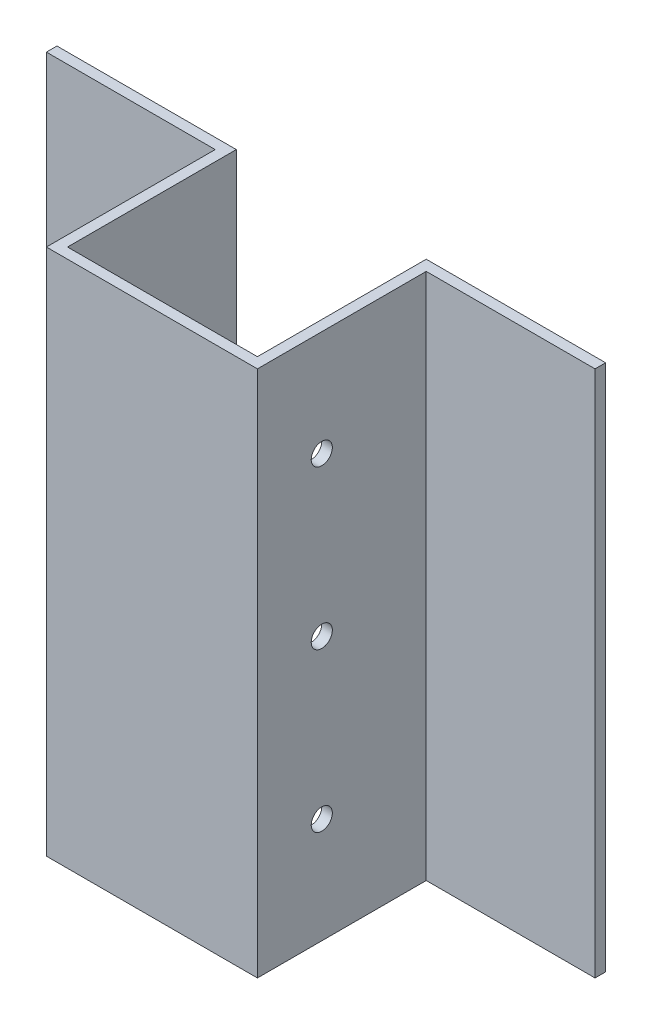
ISO-10303-21;
HEADER;
FILE_DESCRIPTION(('STEP AP214'),'2;1');
FILE_NAME('part.step','',(''),(''),'','','');
FILE_SCHEMA(('AUTOMOTIVE_DESIGN { 1 0 10303 214 1 1 1 1 }'));
ENDSEC;
DATA;
#1=APPLICATION_CONTEXT('core data for automotive mechanical design processes');
#2=APPLICATION_PROTOCOL_DEFINITION('international standard','automotive_design',2000,#1);
#3=PRODUCT_CONTEXT('',#1,'mechanical');
#4=PRODUCT('Part','Part','',(#3));
#5=PRODUCT_RELATED_PRODUCT_CATEGORY('part','',(#4));
#6=PRODUCT_DEFINITION_FORMATION('','',#4);
#7=PRODUCT_DEFINITION_CONTEXT('part definition',#1,'design');
#8=PRODUCT_DEFINITION('design','',#6,#7);
#9=PRODUCT_DEFINITION_SHAPE('','',#8);
#10=(LENGTH_UNIT() NAMED_UNIT(*) SI_UNIT(.MILLI.,.METRE.));
#11=(NAMED_UNIT(*) PLANE_ANGLE_UNIT() SI_UNIT($,.RADIAN.));
#12=(NAMED_UNIT(*) SI_UNIT($,.STERADIAN.) SOLID_ANGLE_UNIT());
#13=UNCERTAINTY_MEASURE_WITH_UNIT(LENGTH_MEASURE(1.E-05),#10,'distance_accuracy_value','');
#14=(GEOMETRIC_REPRESENTATION_CONTEXT(3) GLOBAL_UNCERTAINTY_ASSIGNED_CONTEXT((#13)) GLOBAL_UNIT_ASSIGNED_CONTEXT((#10,
#11,#12)) REPRESENTATION_CONTEXT('',''));
#15=CARTESIAN_POINT('',(0.,0.,0.));
#16=DIRECTION('',(0.,0.,1.));
#17=DIRECTION('',(1.,0.,0.));
#18=AXIS2_PLACEMENT_3D('',#15,#16,#17);
#19=CARTESIAN_POINT('',(0.,250.,5.));
#20=DIRECTION('',(0.,-1.,0.));
#21=DIRECTION('',(0.,0.,-1.));
#22=AXIS2_PLACEMENT_3D('',#19,#20,#21);
#23=PLANE('',#22);
#24=DIRECTION('',(-1.,0.,0.));
#25=VECTOR('',#24,1.);
#26=CARTESIAN_POINT('',(0.,250.,0.));
#27=LINE('',#26,#25);
#28=CARTESIAN_POINT('',(0.,250.,0.));
#29=VERTEX_POINT('',#28);
#30=CARTESIAN_POINT('',(-90.,250.,0.));
#31=VERTEX_POINT('',#30);
#32=EDGE_CURVE('E56',#29,#31,#27,.T.);
#33=ORIENTED_EDGE('',*,*,#32,.T.);
#34=DIRECTION('',(0.,0.,1.));
#35=VECTOR('',#34,1.);
#36=CARTESIAN_POINT('',(-90.,250.,5.));
#37=LINE('',#36,#35);
#38=CARTESIAN_POINT('',(-90.,250.,-80.));
#39=VERTEX_POINT('',#38);
#40=EDGE_CURVE('E131',#39,#31,#37,.T.);
#41=ORIENTED_EDGE('',*,*,#40,.F.);
#42=DIRECTION('',(-1.,0.,0.));
#43=VECTOR('',#42,1.);
#44=CARTESIAN_POINT('',(-90.,250.,-80.));
#45=LINE('',#44,#43);
#46=CARTESIAN_POINT('',(-175.,250.,-80.));
#47=VERTEX_POINT('',#46);
#48=EDGE_CURVE('E140',#39,#47,#45,.T.);
#49=ORIENTED_EDGE('',*,*,#48,.T.);
#50=DIRECTION('',(0.,0.,1.));
#51=VECTOR('',#50,1.);
#52=CARTESIAN_POINT('',(-175.,250.,-80.));
#53=LINE('',#52,#51);
#54=CARTESIAN_POINT('',(-175.,250.,-75.));
#55=VERTEX_POINT('',#54);
#56=EDGE_CURVE('E152',#47,#55,#53,.T.);
#57=ORIENTED_EDGE('',*,*,#56,.T.);
#58=DIRECTION('',(-1.,0.,0.));
#59=VECTOR('',#58,1.);
#60=CARTESIAN_POINT('',(-90.,250.,-75.));
#61=LINE('',#60,#59);
#62=CARTESIAN_POINT('',(-95.,250.,-75.));
#63=VERTEX_POINT('',#62);
#64=EDGE_CURVE('E141',#63,#55,#61,.T.);
#65=ORIENTED_EDGE('',*,*,#64,.F.);
#66=DIRECTION('',(0.,0.,1.));
#67=VECTOR('',#66,1.);
#68=CARTESIAN_POINT('',(-95.,250.,5.));
#69=LINE('',#68,#67);
#70=CARTESIAN_POINT('',(-95.,250.,5.));
#71=VERTEX_POINT('',#70);
#72=EDGE_CURVE('E165',#63,#71,#69,.T.);
#73=ORIENTED_EDGE('',*,*,#72,.T.);
#74=DIRECTION('',(-1.,0.,0.));
#75=VECTOR('',#74,1.);
#76=CARTESIAN_POINT('',(0.,250.,5.));
#77=LINE('',#76,#75);
#78=CARTESIAN_POINT('',(5.,250.,5.));
#79=VERTEX_POINT('',#78);
#80=EDGE_CURVE('E41',#79,#71,#77,.T.);
#81=ORIENTED_EDGE('',*,*,#80,.F.);
#82=DIRECTION('',(0.,0.,1.));
#83=VECTOR('',#82,1.);
#84=CARTESIAN_POINT('',(5.,250.,5.));
#85=LINE('',#84,#83);
#86=CARTESIAN_POINT('',(5.,250.,-75.));
#87=VERTEX_POINT('',#86);
#88=EDGE_CURVE('E262',#87,#79,#85,.T.);
#89=ORIENTED_EDGE('',*,*,#88,.F.);
#90=DIRECTION('',(1.,0.,0.));
#91=VECTOR('',#90,1.);
#92=CARTESIAN_POINT('',(0.,250.,-75.));
#93=LINE('',#92,#91);
#94=CARTESIAN_POINT('',(85.,250.,-75.));
#95=VERTEX_POINT('',#94);
#96=EDGE_CURVE('E185',#87,#95,#93,.T.);
#97=ORIENTED_EDGE('',*,*,#96,.T.);
#98=DIRECTION('',(0.,0.,1.));
#99=VECTOR('',#98,1.);
#100=CARTESIAN_POINT('',(85.,250.,-80.));
#101=LINE('',#100,#99);
#102=CARTESIAN_POINT('',(85.,250.,-80.));
#103=VERTEX_POINT('',#102);
#104=EDGE_CURVE('E276',#103,#95,#101,.T.);
#105=ORIENTED_EDGE('',*,*,#104,.F.);
#106=DIRECTION('',(1.,0.,0.));
#107=VECTOR('',#106,1.);
#108=CARTESIAN_POINT('',(0.,250.,-80.));
#109=LINE('',#108,#107);
#110=CARTESIAN_POINT('',(0.,250.,-80.));
#111=VERTEX_POINT('',#110);
#112=EDGE_CURVE('E303',#111,#103,#109,.T.);
#113=ORIENTED_EDGE('',*,*,#112,.F.);
#114=DIRECTION('',(0.,0.,1.));
#115=VECTOR('',#114,1.);
#116=CARTESIAN_POINT('',(0.,250.,5.));
#117=LINE('',#116,#115);
#118=EDGE_CURVE('E246',#111,#29,#117,.T.);
#119=ORIENTED_EDGE('',*,*,#118,.T.);
#120=EDGE_LOOP('',(#33,#41,#49,#57,#65,#73,#81,#89,#97,#105,#113,#119));
#121=FACE_BOUND('',#120,.T.);
#122=ADVANCED_FACE('F33',(#121),#23,.F.);
#123=CARTESIAN_POINT('',(0.,0.,5.));
#124=DIRECTION('',(0.,1.,0.));
#125=DIRECTION('',(-1.,0.,0.));
#126=AXIS2_PLACEMENT_3D('',#123,#124,#125);
#127=PLANE('',#126);
#128=DIRECTION('',(1.,0.,0.));
#129=VECTOR('',#128,1.);
#130=CARTESIAN_POINT('',(0.,0.,0.));
#131=LINE('',#130,#129);
#132=CARTESIAN_POINT('',(-90.,0.,0.));
#133=VERTEX_POINT('',#132);
#134=CARTESIAN_POINT('',(0.,0.,0.));
#135=VERTEX_POINT('',#134);
#136=EDGE_CURVE('E49',#133,#135,#131,.T.);
#137=ORIENTED_EDGE('',*,*,#136,.T.);
#138=DIRECTION('',(0.,0.,-1.));
#139=VECTOR('',#138,1.);
#140=CARTESIAN_POINT('',(0.,0.,5.));
#141=LINE('',#140,#139);
#142=CARTESIAN_POINT('',(0.,0.,-80.));
#143=VERTEX_POINT('',#142);
#144=EDGE_CURVE('E275',#135,#143,#141,.T.);
#145=ORIENTED_EDGE('',*,*,#144,.T.);
#146=DIRECTION('',(-1.,0.,0.));
#147=VECTOR('',#146,1.);
#148=CARTESIAN_POINT('',(0.,0.,-80.));
#149=LINE('',#148,#147);
#150=CARTESIAN_POINT('',(85.,0.,-80.));
#151=VERTEX_POINT('',#150);
#152=EDGE_CURVE('E310',#151,#143,#149,.T.);
#153=ORIENTED_EDGE('',*,*,#152,.F.);
#154=DIRECTION('',(0.,0.,1.));
#155=VECTOR('',#154,1.);
#156=CARTESIAN_POINT('',(85.,0.,-80.));
#157=LINE('',#156,#155);
#158=CARTESIAN_POINT('',(85.,0.,-75.));
#159=VERTEX_POINT('',#158);
#160=EDGE_CURVE('E297',#151,#159,#157,.T.);
#161=ORIENTED_EDGE('',*,*,#160,.T.);
#162=DIRECTION('',(-1.,0.,0.));
#163=VECTOR('',#162,1.);
#164=CARTESIAN_POINT('',(0.,0.,-75.));
#165=LINE('',#164,#163);
#166=CARTESIAN_POINT('',(5.,0.,-75.));
#167=VERTEX_POINT('',#166);
#168=EDGE_CURVE('E294',#159,#167,#165,.T.);
#169=ORIENTED_EDGE('',*,*,#168,.T.);
#170=DIRECTION('',(0.,0.,-1.));
#171=VECTOR('',#170,1.);
#172=CARTESIAN_POINT('',(5.,0.,5.));
#173=LINE('',#172,#171);
#174=CARTESIAN_POINT('',(5.,0.,5.));
#175=VERTEX_POINT('',#174);
#176=EDGE_CURVE('E263',#175,#167,#173,.T.);
#177=ORIENTED_EDGE('',*,*,#176,.F.);
#178=DIRECTION('',(1.,0.,0.));
#179=VECTOR('',#178,1.);
#180=CARTESIAN_POINT('',(0.,0.,5.));
#181=LINE('',#180,#179);
#182=CARTESIAN_POINT('',(-95.,0.,5.));
#183=VERTEX_POINT('',#182);
#184=EDGE_CURVE('E11',#183,#175,#181,.T.);
#185=ORIENTED_EDGE('',*,*,#184,.F.);
#186=DIRECTION('',(0.,0.,-1.));
#187=VECTOR('',#186,1.);
#188=CARTESIAN_POINT('',(-95.,0.,5.));
#189=LINE('',#188,#187);
#190=CARTESIAN_POINT('',(-95.,0.,-75.));
#191=VERTEX_POINT('',#190);
#192=EDGE_CURVE('E170',#183,#191,#189,.T.);
#193=ORIENTED_EDGE('',*,*,#192,.T.);
#194=DIRECTION('',(1.,0.,0.));
#195=VECTOR('',#194,1.);
#196=CARTESIAN_POINT('',(-90.,0.,-75.));
#197=LINE('',#196,#195);
#198=CARTESIAN_POINT('',(-175.,0.,-75.));
#199=VERTEX_POINT('',#198);
#200=EDGE_CURVE('E153',#199,#191,#197,.T.);
#201=ORIENTED_EDGE('',*,*,#200,.F.);
#202=DIRECTION('',(0.,0.,1.));
#203=VECTOR('',#202,1.);
#204=CARTESIAN_POINT('',(-175.,0.,-80.));
#205=LINE('',#204,#203);
#206=CARTESIAN_POINT('',(-175.,0.,-80.));
#207=VERTEX_POINT('',#206);
#208=EDGE_CURVE('E145',#207,#199,#205,.T.);
#209=ORIENTED_EDGE('',*,*,#208,.F.);
#210=DIRECTION('',(1.,0.,0.));
#211=VECTOR('',#210,1.);
#212=CARTESIAN_POINT('',(-90.,0.,-80.));
#213=LINE('',#212,#211);
#214=CARTESIAN_POINT('',(-90.,0.,-80.));
#215=VERTEX_POINT('',#214);
#216=EDGE_CURVE('E137',#207,#215,#213,.T.);
#217=ORIENTED_EDGE('',*,*,#216,.T.);
#218=DIRECTION('',(0.,0.,-1.));
#219=VECTOR('',#218,1.);
#220=CARTESIAN_POINT('',(-90.,0.,5.));
#221=LINE('',#220,#219);
#222=EDGE_CURVE('E123',#133,#215,#221,.T.);
#223=ORIENTED_EDGE('',*,*,#222,.F.);
#224=EDGE_LOOP('',(#137,#145,#153,#161,#169,#177,#185,#193,#201,#209,#217,#223));
#225=FACE_BOUND('',#224,.T.);
#226=ADVANCED_FACE('F143',(#225),#127,.F.);
#227=CARTESIAN_POINT('',(0.,0.,5.));
#228=DIRECTION('',(0.,0.,1.));
#229=DIRECTION('',(1.,0.,0.));
#230=AXIS2_PLACEMENT_3D('',#227,#228,#229);
#231=PLANE('',#230);
#232=ORIENTED_EDGE('',*,*,#184,.T.);
#233=DIRECTION('',(0.,-1.,0.));
#234=VECTOR('',#233,1.);
#235=CARTESIAN_POINT('',(5.,250.,5.));
#236=LINE('',#235,#234);
#237=EDGE_CURVE('E268',#79,#175,#236,.T.);
#238=ORIENTED_EDGE('',*,*,#237,.F.);
#239=ORIENTED_EDGE('',*,*,#80,.T.);
#240=DIRECTION('',(0.,-1.,0.));
#241=VECTOR('',#240,1.);
#242=CARTESIAN_POINT('',(-95.,250.,5.));
#243=LINE('',#242,#241);
#244=EDGE_CURVE('E130',#71,#183,#243,.T.);
#245=ORIENTED_EDGE('',*,*,#244,.T.);
#246=EDGE_LOOP('',(#232,#238,#239,#245));
#247=FACE_BOUND('',#246,.T.);
#248=ADVANCED_FACE('F243',(#247),#231,.T.);
#249=CARTESIAN_POINT('',(0.,0.,0.));
#250=DIRECTION('',(0.,0.,1.));
#251=DIRECTION('',(1.,0.,0.));
#252=AXIS2_PLACEMENT_3D('',#249,#250,#251);
#253=PLANE('',#252);
#254=DIRECTION('',(0.,1.,0.));
#255=VECTOR('',#254,1.);
#256=CARTESIAN_POINT('',(0.,0.,0.));
#257=LINE('',#256,#255);
#258=EDGE_CURVE('E247',#135,#29,#257,.T.);
#259=ORIENTED_EDGE('',*,*,#258,.F.);
#260=ORIENTED_EDGE('',*,*,#136,.F.);
#261=DIRECTION('',(0.,1.,0.));
#262=VECTOR('',#261,1.);
#263=CARTESIAN_POINT('',(-90.,0.,0.));
#264=LINE('',#263,#262);
#265=EDGE_CURVE('E128',#133,#31,#264,.T.);
#266=ORIENTED_EDGE('',*,*,#265,.T.);
#267=ORIENTED_EDGE('',*,*,#32,.F.);
#268=EDGE_LOOP('',(#259,#260,#266,#267));
#269=FACE_BOUND('',#268,.T.);
#270=ADVANCED_FACE('F249',(#269),#253,.F.);
#271=CARTESIAN_POINT('',(0.,0.,0.));
#272=DIRECTION('',(1.,0.,0.));
#273=DIRECTION('',(0.,0.,-1.));
#274=AXIS2_PLACEMENT_3D('',#271,#272,#273);
#275=PLANE('',#274);
#276=CARTESIAN_POINT('',(0.,50.,-25.5));
#277=DIRECTION('',(1.,0.,0.));
#278=DIRECTION('',(0.,0.,-1.));
#279=AXIS2_PLACEMENT_3D('',#276,#277,#278);
#280=CIRCLE('',#279,5.00000000000001);
#281=CARTESIAN_POINT('',(0.,50.,-30.5));
#282=VERTEX_POINT('',#281);
#283=EDGE_CURVE('E202',#282,#282,#280,.T.);
#284=ORIENTED_EDGE('',*,*,#283,.T.);
#285=EDGE_LOOP('',(#284));
#286=FACE_BOUND('',#285,.T.);
#287=CARTESIAN_POINT('',(0.,200.,-25.5));
#288=DIRECTION('',(1.,0.,0.));
#289=DIRECTION('',(0.,0.,-1.));
#290=AXIS2_PLACEMENT_3D('',#287,#288,#289);
#291=CIRCLE('',#290,5.00000000000001);
#292=CARTESIAN_POINT('',(0.,200.,-30.5));
#293=VERTEX_POINT('',#292);
#294=EDGE_CURVE('E199',#293,#293,#291,.T.);
#295=ORIENTED_EDGE('',*,*,#294,.T.);
#296=EDGE_LOOP('',(#295));
#297=FACE_BOUND('',#296,.T.);
#298=CARTESIAN_POINT('',(0.,125.,-25.5));
#299=DIRECTION('',(1.,0.,0.));
#300=DIRECTION('',(0.,0.,-1.));
#301=AXIS2_PLACEMENT_3D('',#298,#299,#300);
#302=CIRCLE('',#301,5.00000000000001);
#303=CARTESIAN_POINT('',(0.,125.,-30.5));
#304=VERTEX_POINT('',#303);
#305=EDGE_CURVE('E156',#304,#304,#302,.T.);
#306=ORIENTED_EDGE('',*,*,#305,.T.);
#307=EDGE_LOOP('',(#306));
#308=FACE_BOUND('',#307,.T.);
#309=ORIENTED_EDGE('',*,*,#144,.F.);
#310=ORIENTED_EDGE('',*,*,#258,.T.);
#311=ORIENTED_EDGE('',*,*,#118,.F.);
#312=DIRECTION('',(0.,1.,0.));
#313=VECTOR('',#312,1.);
#314=CARTESIAN_POINT('',(0.,250.,-80.));
#315=LINE('',#314,#313);
#316=EDGE_CURVE('E180',#143,#111,#315,.T.);
#317=ORIENTED_EDGE('',*,*,#316,.F.);
#318=EDGE_LOOP('',(#309,#310,#311,#317));
#319=FACE_BOUND('',#318,.T.);
#320=ADVANCED_FACE('F219',(#286,#297,#308,#319),#275,.F.);
#321=CARTESIAN_POINT('',(5.,0.,0.));
#322=DIRECTION('',(1.,0.,0.));
#323=DIRECTION('',(0.,0.,-1.));
#324=AXIS2_PLACEMENT_3D('',#321,#322,#323);
#325=PLANE('',#324);
#326=CARTESIAN_POINT('',(5.,50.,-25.5));
#327=DIRECTION('',(1.,0.,0.));
#328=DIRECTION('',(0.,0.,-1.));
#329=AXIS2_PLACEMENT_3D('',#326,#327,#328);
#330=CIRCLE('',#329,5.00000000000001);
#331=CARTESIAN_POINT('',(5.,50.,-30.5));
#332=VERTEX_POINT('',#331);
#333=EDGE_CURVE('E462',#332,#332,#330,.T.);
#334=ORIENTED_EDGE('',*,*,#333,.F.);
#335=EDGE_LOOP('',(#334));
#336=FACE_BOUND('',#335,.T.);
#337=CARTESIAN_POINT('',(5.,200.,-25.5));
#338=DIRECTION('',(1.,0.,0.));
#339=DIRECTION('',(0.,0.,-1.));
#340=AXIS2_PLACEMENT_3D('',#337,#338,#339);
#341=CIRCLE('',#340,5.00000000000001);
#342=CARTESIAN_POINT('',(5.,200.,-30.5));
#343=VERTEX_POINT('',#342);
#344=EDGE_CURVE('E195',#343,#343,#341,.T.);
#345=ORIENTED_EDGE('',*,*,#344,.F.);
#346=EDGE_LOOP('',(#345));
#347=FACE_BOUND('',#346,.T.);
#348=CARTESIAN_POINT('',(5.,125.,-25.5));
#349=DIRECTION('',(1.,0.,0.));
#350=DIRECTION('',(0.,0.,-1.));
#351=AXIS2_PLACEMENT_3D('',#348,#349,#350);
#352=CIRCLE('',#351,5.00000000000001);
#353=CARTESIAN_POINT('',(5.,125.,-30.5));
#354=VERTEX_POINT('',#353);
#355=EDGE_CURVE('E191',#354,#354,#352,.T.);
#356=ORIENTED_EDGE('',*,*,#355,.F.);
#357=EDGE_LOOP('',(#356));
#358=FACE_BOUND('',#357,.T.);
#359=ORIENTED_EDGE('',*,*,#237,.T.);
#360=ORIENTED_EDGE('',*,*,#176,.T.);
#361=DIRECTION('',(0.,1.,0.));
#362=VECTOR('',#361,1.);
#363=CARTESIAN_POINT('',(5.,250.,-75.));
#364=LINE('',#363,#362);
#365=EDGE_CURVE('E258',#167,#87,#364,.T.);
#366=ORIENTED_EDGE('',*,*,#365,.T.);
#367=ORIENTED_EDGE('',*,*,#88,.T.);
#368=EDGE_LOOP('',(#359,#360,#366,#367));
#369=FACE_BOUND('',#368,.T.);
#370=ADVANCED_FACE('F285',(#336,#347,#358,#369),#325,.T.);
#371=CARTESIAN_POINT('',(0.,0.,-75.));
#372=DIRECTION('',(0.,0.,1.));
#373=DIRECTION('',(0.,-1.,0.));
#374=AXIS2_PLACEMENT_3D('',#371,#372,#373);
#375=PLANE('',#374);
#376=ORIENTED_EDGE('',*,*,#365,.F.);
#377=ORIENTED_EDGE('',*,*,#168,.F.);
#378=DIRECTION('',(0.,-1.,0.));
#379=VECTOR('',#378,1.);
#380=CARTESIAN_POINT('',(85.,250.,-75.));
#381=LINE('',#380,#379);
#382=EDGE_CURVE('E300',#95,#159,#381,.T.);
#383=ORIENTED_EDGE('',*,*,#382,.F.);
#384=ORIENTED_EDGE('',*,*,#96,.F.);
#385=EDGE_LOOP('',(#376,#377,#383,#384));
#386=FACE_BOUND('',#385,.T.);
#387=ADVANCED_FACE('F331',(#386),#375,.T.);
#388=CARTESIAN_POINT('',(85.,250.,-80.));
#389=DIRECTION('',(-1.,0.,0.));
#390=DIRECTION('',(0.,-1.,0.));
#391=AXIS2_PLACEMENT_3D('',#388,#389,#390);
#392=PLANE('',#391);
#393=ORIENTED_EDGE('',*,*,#382,.T.);
#394=ORIENTED_EDGE('',*,*,#160,.F.);
#395=DIRECTION('',(0.,-1.,0.));
#396=VECTOR('',#395,1.);
#397=CARTESIAN_POINT('',(85.,250.,-80.));
#398=LINE('',#397,#396);
#399=EDGE_CURVE('E313',#103,#151,#398,.T.);
#400=ORIENTED_EDGE('',*,*,#399,.F.);
#401=ORIENTED_EDGE('',*,*,#104,.T.);
#402=EDGE_LOOP('',(#393,#394,#400,#401));
#403=FACE_BOUND('',#402,.T.);
#404=ADVANCED_FACE('F323',(#403),#392,.F.);
#405=CARTESIAN_POINT('',(0.,0.,-80.));
#406=DIRECTION('',(0.,0.,1.));
#407=DIRECTION('',(0.,-1.,0.));
#408=AXIS2_PLACEMENT_3D('',#405,#406,#407);
#409=PLANE('',#408);
#410=ORIENTED_EDGE('',*,*,#316,.T.);
#411=ORIENTED_EDGE('',*,*,#112,.T.);
#412=ORIENTED_EDGE('',*,*,#399,.T.);
#413=ORIENTED_EDGE('',*,*,#152,.T.);
#414=EDGE_LOOP('',(#410,#411,#412,#413));
#415=FACE_BOUND('',#414,.T.);
#416=ADVANCED_FACE('F320',(#415),#409,.F.);
#417=CARTESIAN_POINT('',(-95.,0.,0.));
#418=DIRECTION('',(-1.,0.,0.));
#419=DIRECTION('',(0.,0.,-1.));
#420=AXIS2_PLACEMENT_3D('',#417,#418,#419);
#421=PLANE('',#420);
#422=CARTESIAN_POINT('',(-95.,50.,-25.5));
#423=DIRECTION('',(-1.,0.,0.));
#424=DIRECTION('',(0.,0.,1.));
#425=AXIS2_PLACEMENT_3D('',#422,#423,#424);
#426=CIRCLE('',#425,5.00000000000001);
#427=CARTESIAN_POINT('',(-95.,50.,-20.5));
#428=VERTEX_POINT('',#427);
#429=EDGE_CURVE('E207',#428,#428,#426,.T.);
#430=ORIENTED_EDGE('',*,*,#429,.F.);
#431=EDGE_LOOP('',(#430));
#432=FACE_BOUND('',#431,.T.);
#433=CARTESIAN_POINT('',(-95.,200.,-25.5));
#434=DIRECTION('',(-1.,0.,0.));
#435=DIRECTION('',(0.,0.,1.));
#436=AXIS2_PLACEMENT_3D('',#433,#434,#435);
#437=CIRCLE('',#436,5.00000000000001);
#438=CARTESIAN_POINT('',(-95.,200.,-20.5));
#439=VERTEX_POINT('',#438);
#440=EDGE_CURVE('E194',#439,#439,#437,.T.);
#441=ORIENTED_EDGE('',*,*,#440,.F.);
#442=EDGE_LOOP('',(#441));
#443=FACE_BOUND('',#442,.T.);
#444=CARTESIAN_POINT('',(-95.,125.,-25.5));
#445=DIRECTION('',(-1.,0.,0.));
#446=DIRECTION('',(0.,0.,1.));
#447=AXIS2_PLACEMENT_3D('',#444,#445,#446);
#448=CIRCLE('',#447,5.00000000000001);
#449=CARTESIAN_POINT('',(-95.,125.,-20.5));
#450=VERTEX_POINT('',#449);
#451=EDGE_CURVE('E190',#450,#450,#448,.T.);
#452=ORIENTED_EDGE('',*,*,#451,.F.);
#453=EDGE_LOOP('',(#452));
#454=FACE_BOUND('',#453,.T.);
#455=ORIENTED_EDGE('',*,*,#244,.F.);
#456=ORIENTED_EDGE('',*,*,#72,.F.);
#457=DIRECTION('',(0.,1.,0.));
#458=VECTOR('',#457,1.);
#459=CARTESIAN_POINT('',(-95.,250.,-75.));
#460=LINE('',#459,#458);
#461=EDGE_CURVE('E168',#191,#63,#460,.T.);
#462=ORIENTED_EDGE('',*,*,#461,.F.);
#463=ORIENTED_EDGE('',*,*,#192,.F.);
#464=EDGE_LOOP('',(#455,#456,#462,#463));
#465=FACE_BOUND('',#464,.T.);
#466=ADVANCED_FACE('F399',(#432,#443,#454,#465),#421,.T.);
#467=CARTESIAN_POINT('',(-90.,0.,0.));
#468=DIRECTION('',(-1.,0.,0.));
#469=DIRECTION('',(0.,0.,-1.));
#470=AXIS2_PLACEMENT_3D('',#467,#468,#469);
#471=PLANE('',#470);
#472=CARTESIAN_POINT('',(-90.,50.,-25.5));
#473=DIRECTION('',(-1.,0.,0.));
#474=DIRECTION('',(0.,0.,1.));
#475=AXIS2_PLACEMENT_3D('',#472,#473,#474);
#476=CIRCLE('',#475,5.00000000000001);
#477=CARTESIAN_POINT('',(-90.,50.,-20.5));
#478=VERTEX_POINT('',#477);
#479=EDGE_CURVE('E36',#478,#478,#476,.T.);
#480=ORIENTED_EDGE('',*,*,#479,.T.);
#481=EDGE_LOOP('',(#480));
#482=FACE_BOUND('',#481,.T.);
#483=CARTESIAN_POINT('',(-90.,200.,-25.5));
#484=DIRECTION('',(-1.,0.,0.));
#485=DIRECTION('',(0.,0.,1.));
#486=AXIS2_PLACEMENT_3D('',#483,#484,#485);
#487=CIRCLE('',#486,5.00000000000001);
#488=CARTESIAN_POINT('',(-90.,200.,-20.5));
#489=VERTEX_POINT('',#488);
#490=EDGE_CURVE('E192',#489,#489,#487,.T.);
#491=ORIENTED_EDGE('',*,*,#490,.T.);
#492=EDGE_LOOP('',(#491));
#493=FACE_BOUND('',#492,.T.);
#494=CARTESIAN_POINT('',(-90.,125.,-25.5));
#495=DIRECTION('',(-1.,0.,0.));
#496=DIRECTION('',(0.,0.,1.));
#497=AXIS2_PLACEMENT_3D('',#494,#495,#496);
#498=CIRCLE('',#497,5.00000000000001);
#499=CARTESIAN_POINT('',(-90.,125.,-20.5));
#500=VERTEX_POINT('',#499);
#501=EDGE_CURVE('E188',#500,#500,#498,.T.);
#502=ORIENTED_EDGE('',*,*,#501,.T.);
#503=EDGE_LOOP('',(#502));
#504=FACE_BOUND('',#503,.T.);
#505=ORIENTED_EDGE('',*,*,#265,.F.);
#506=ORIENTED_EDGE('',*,*,#222,.T.);
#507=DIRECTION('',(0.,1.,0.));
#508=VECTOR('',#507,1.);
#509=CARTESIAN_POINT('',(-90.,250.,-80.));
#510=LINE('',#509,#508);
#511=EDGE_CURVE('E126',#215,#39,#510,.T.);
#512=ORIENTED_EDGE('',*,*,#511,.T.);
#513=ORIENTED_EDGE('',*,*,#40,.T.);
#514=EDGE_LOOP('',(#505,#506,#512,#513));
#515=FACE_BOUND('',#514,.T.);
#516=ADVANCED_FACE('F125',(#482,#493,#504,#515),#471,.F.);
#517=CARTESIAN_POINT('',(-175.,250.,-80.));
#518=DIRECTION('',(-1.,0.,0.));
#519=DIRECTION('',(0.,-1.,0.));
#520=AXIS2_PLACEMENT_3D('',#517,#518,#519);
#521=PLANE('',#520);
#522=DIRECTION('',(0.,-1.,0.));
#523=VECTOR('',#522,1.);
#524=CARTESIAN_POINT('',(-175.,250.,-75.));
#525=LINE('',#524,#523);
#526=EDGE_CURVE('E155',#55,#199,#525,.T.);
#527=ORIENTED_EDGE('',*,*,#526,.F.);
#528=ORIENTED_EDGE('',*,*,#56,.F.);
#529=DIRECTION('',(0.,-1.,0.));
#530=VECTOR('',#529,1.);
#531=CARTESIAN_POINT('',(-175.,250.,-80.));
#532=LINE('',#531,#530);
#533=EDGE_CURVE('E146',#47,#207,#532,.T.);
#534=ORIENTED_EDGE('',*,*,#533,.T.);
#535=ORIENTED_EDGE('',*,*,#208,.T.);
#536=EDGE_LOOP('',(#527,#528,#534,#535));
#537=FACE_BOUND('',#536,.T.);
#538=ADVANCED_FACE('F355',(#537),#521,.T.);
#539=CARTESIAN_POINT('',(-90.,0.,-80.));
#540=DIRECTION('',(0.,0.,1.));
#541=DIRECTION('',(0.,-1.,0.));
#542=AXIS2_PLACEMENT_3D('',#539,#540,#541);
#543=PLANE('',#542);
#544=ORIENTED_EDGE('',*,*,#511,.F.);
#545=ORIENTED_EDGE('',*,*,#216,.F.);
#546=ORIENTED_EDGE('',*,*,#533,.F.);
#547=ORIENTED_EDGE('',*,*,#48,.F.);
#548=EDGE_LOOP('',(#544,#545,#546,#547));
#549=FACE_BOUND('',#548,.T.);
#550=ADVANCED_FACE('F135',(#549),#543,.F.);
#551=CARTESIAN_POINT('',(-90.,0.,-75.));
#552=DIRECTION('',(0.,0.,1.));
#553=DIRECTION('',(0.,-1.,0.));
#554=AXIS2_PLACEMENT_3D('',#551,#552,#553);
#555=PLANE('',#554);
#556=ORIENTED_EDGE('',*,*,#200,.T.);
#557=ORIENTED_EDGE('',*,*,#461,.T.);
#558=ORIENTED_EDGE('',*,*,#64,.T.);
#559=ORIENTED_EDGE('',*,*,#526,.T.);
#560=EDGE_LOOP('',(#556,#557,#558,#559));
#561=FACE_BOUND('',#560,.T.);
#562=ADVANCED_FACE('F235',(#561),#555,.T.);
#563=CARTESIAN_POINT('',(-175.,125.,-25.5));
#564=DIRECTION('',(1.,0.,0.));
#565=DIRECTION('',(0.,0.,-1.));
#566=AXIS2_PLACEMENT_3D('',#563,#564,#565);
#567=CYLINDRICAL_SURFACE('',#566,5.00000000000001);
#568=ORIENTED_EDGE('',*,*,#451,.T.);
#569=EDGE_LOOP('',(#568));
#570=FACE_BOUND('',#569,.T.);
#571=ORIENTED_EDGE('',*,*,#501,.F.);
#572=EDGE_LOOP('',(#571));
#573=FACE_BOUND('',#572,.T.);
#574=ADVANCED_FACE('F225',(#570,#573),#567,.F.);
#575=ORIENTED_EDGE('',*,*,#355,.T.);
#576=EDGE_LOOP('',(#575));
#577=FACE_BOUND('',#576,.T.);
#578=ORIENTED_EDGE('',*,*,#305,.F.);
#579=EDGE_LOOP('',(#578));
#580=FACE_BOUND('',#579,.T.);
#581=ADVANCED_FACE('F222',(#577,#580),#567,.F.);
#582=CARTESIAN_POINT('',(-175.,200.,-25.5));
#583=DIRECTION('',(1.,0.,0.));
#584=DIRECTION('',(0.,0.,-1.));
#585=AXIS2_PLACEMENT_3D('',#582,#583,#584);
#586=CYLINDRICAL_SURFACE('',#585,5.00000000000001);
#587=ORIENTED_EDGE('',*,*,#440,.T.);
#588=EDGE_LOOP('',(#587));
#589=FACE_BOUND('',#588,.T.);
#590=ORIENTED_EDGE('',*,*,#490,.F.);
#591=EDGE_LOOP('',(#590));
#592=FACE_BOUND('',#591,.T.);
#593=ADVANCED_FACE('F224',(#589,#592),#586,.F.);
#594=ORIENTED_EDGE('',*,*,#344,.T.);
#595=EDGE_LOOP('',(#594));
#596=FACE_BOUND('',#595,.T.);
#597=ORIENTED_EDGE('',*,*,#294,.F.);
#598=EDGE_LOOP('',(#597));
#599=FACE_BOUND('',#598,.T.);
#600=ADVANCED_FACE('F232',(#596,#599),#586,.F.);
#601=CARTESIAN_POINT('',(-175.,50.,-25.5));
#602=DIRECTION('',(1.,0.,0.));
#603=DIRECTION('',(0.,0.,-1.));
#604=AXIS2_PLACEMENT_3D('',#601,#602,#603);
#605=CYLINDRICAL_SURFACE('',#604,5.00000000000001);
#606=ORIENTED_EDGE('',*,*,#429,.T.);
#607=EDGE_LOOP('',(#606));
#608=FACE_BOUND('',#607,.T.);
#609=ORIENTED_EDGE('',*,*,#479,.F.);
#610=EDGE_LOOP('',(#609));
#611=FACE_BOUND('',#610,.T.);
#612=ADVANCED_FACE('F438',(#608,#611),#605,.F.);
#613=ORIENTED_EDGE('',*,*,#333,.T.);
#614=EDGE_LOOP('',(#613));
#615=FACE_BOUND('',#614,.T.);
#616=ORIENTED_EDGE('',*,*,#283,.F.);
#617=EDGE_LOOP('',(#616));
#618=FACE_BOUND('',#617,.T.);
#619=ADVANCED_FACE('F446',(#615,#618),#605,.F.);
#620=CLOSED_SHELL('',(#122,#226,#248,#270,#320,#370,#387,#404,#416,#466,#516,#538,#550,#562,
#574,#581,#593,#600,#612,#619));
#621=MANIFOLD_SOLID_BREP('B2',#620);
#622=ADVANCED_BREP_SHAPE_REPRESENTATION('',(#18,#621),#14);
#623=SHAPE_DEFINITION_REPRESENTATION(#9,#622);
ENDSEC;
END-ISO-10303-21;
